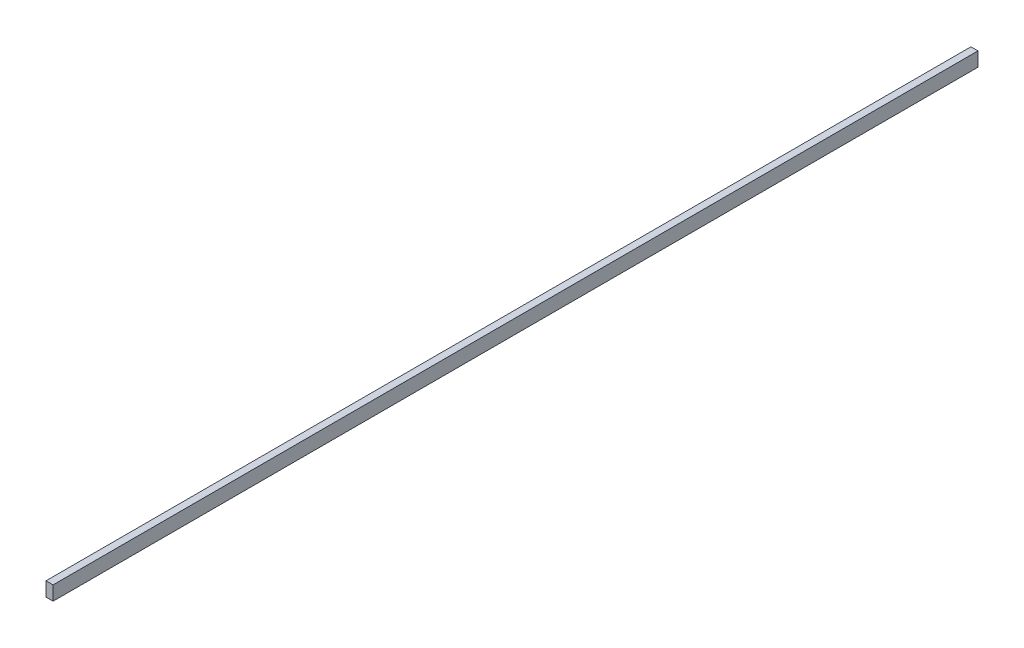
ISO-10303-21;
HEADER;
FILE_DESCRIPTION(('STEP AP214'),'2;1');
FILE_NAME('part.step','',(''),(''),'','','');
FILE_SCHEMA(('AUTOMOTIVE_DESIGN { 1 0 10303 214 1 1 1 1 }'));
ENDSEC;
DATA;
#1=APPLICATION_CONTEXT('core data for automotive mechanical design processes');
#2=APPLICATION_PROTOCOL_DEFINITION('international standard','automotive_design',2000,#1);
#3=PRODUCT_CONTEXT('',#1,'mechanical');
#4=PRODUCT('Part','Part','',(#3));
#5=PRODUCT_RELATED_PRODUCT_CATEGORY('part','',(#4));
#6=PRODUCT_DEFINITION_FORMATION('','',#4);
#7=PRODUCT_DEFINITION_CONTEXT('part definition',#1,'design');
#8=PRODUCT_DEFINITION('design','',#6,#7);
#9=PRODUCT_DEFINITION_SHAPE('','',#8);
#10=(LENGTH_UNIT() NAMED_UNIT(*) SI_UNIT(.MILLI.,.METRE.));
#11=(NAMED_UNIT(*) PLANE_ANGLE_UNIT() SI_UNIT($,.RADIAN.));
#12=(NAMED_UNIT(*) SI_UNIT($,.STERADIAN.) SOLID_ANGLE_UNIT());
#13=UNCERTAINTY_MEASURE_WITH_UNIT(LENGTH_MEASURE(1.E-05),#10,'distance_accuracy_value','');
#14=(GEOMETRIC_REPRESENTATION_CONTEXT(3) GLOBAL_UNCERTAINTY_ASSIGNED_CONTEXT((#13)) GLOBAL_UNIT_ASSIGNED_CONTEXT((#10,
#11,#12)) REPRESENTATION_CONTEXT('',''));
#15=CARTESIAN_POINT('',(0.,0.,0.));
#16=DIRECTION('',(0.,0.,1.));
#17=DIRECTION('',(1.,0.,0.));
#18=AXIS2_PLACEMENT_3D('',#15,#16,#17);
#19=CARTESIAN_POINT('',(0.,0.,415.));
#20=DIRECTION('',(1.,0.,0.));
#21=DIRECTION('',(0.,0.,-1.));
#22=AXIS2_PLACEMENT_3D('',#19,#20,#21);
#23=PLANE('',#22);
#24=DIRECTION('',(0.,-1.,0.));
#25=VECTOR('',#24,1.);
#26=CARTESIAN_POINT('',(0.,0.,0.));
#27=LINE('',#26,#25);
#28=CARTESIAN_POINT('',(0.,6.35,0.));
#29=VERTEX_POINT('',#28);
#30=CARTESIAN_POINT('',(0.,0.,0.));
#31=VERTEX_POINT('',#30);
#32=EDGE_CURVE('E107',#29,#31,#27,.T.);
#33=ORIENTED_EDGE('',*,*,#32,.T.);
#34=DIRECTION('',(0.,0.,-1.));
#35=VECTOR('',#34,1.);
#36=CARTESIAN_POINT('',(0.,0.,415.));
#37=LINE('',#36,#35);
#38=CARTESIAN_POINT('',(0.,0.,415.));
#39=VERTEX_POINT('',#38);
#40=EDGE_CURVE('E11',#39,#31,#37,.T.);
#41=ORIENTED_EDGE('',*,*,#40,.F.);
#42=DIRECTION('',(0.,-1.,0.));
#43=VECTOR('',#42,1.);
#44=CARTESIAN_POINT('',(0.,0.,415.));
#45=LINE('',#44,#43);
#46=CARTESIAN_POINT('',(0.,6.35,415.));
#47=VERTEX_POINT('',#46);
#48=EDGE_CURVE('E91',#47,#39,#45,.T.);
#49=ORIENTED_EDGE('',*,*,#48,.F.);
#50=DIRECTION('',(0.,0.,-1.));
#51=VECTOR('',#50,1.);
#52=CARTESIAN_POINT('',(0.,6.35,415.));
#53=LINE('',#52,#51);
#54=EDGE_CURVE('E103',#47,#29,#53,.T.);
#55=ORIENTED_EDGE('',*,*,#54,.T.);
#56=EDGE_LOOP('',(#33,#41,#49,#55));
#57=FACE_BOUND('',#56,.T.);
#58=ADVANCED_FACE('F39',(#57),#23,.F.);
#59=CARTESIAN_POINT('',(0.,0.,415.));
#60=DIRECTION('',(0.,1.,0.));
#61=DIRECTION('',(0.,0.,1.));
#62=AXIS2_PLACEMENT_3D('',#59,#60,#61);
#63=PLANE('',#62);
#64=DIRECTION('',(1.,0.,0.));
#65=VECTOR('',#64,1.);
#66=CARTESIAN_POINT('',(0.,0.,0.));
#67=LINE('',#66,#65);
#68=CARTESIAN_POINT('',(3.175,0.,0.));
#69=VERTEX_POINT('',#68);
#70=EDGE_CURVE('E96',#31,#69,#67,.T.);
#71=ORIENTED_EDGE('',*,*,#70,.T.);
#72=DIRECTION('',(0.,0.,-1.));
#73=VECTOR('',#72,1.);
#74=CARTESIAN_POINT('',(3.175,0.,415.));
#75=LINE('',#74,#73);
#76=CARTESIAN_POINT('',(3.175,0.,415.));
#77=VERTEX_POINT('',#76);
#78=EDGE_CURVE('E48',#77,#69,#75,.T.);
#79=ORIENTED_EDGE('',*,*,#78,.F.);
#80=DIRECTION('',(1.,0.,0.));
#81=VECTOR('',#80,1.);
#82=CARTESIAN_POINT('',(0.,0.,415.));
#83=LINE('',#82,#81);
#84=EDGE_CURVE('E86',#39,#77,#83,.T.);
#85=ORIENTED_EDGE('',*,*,#84,.F.);
#86=ORIENTED_EDGE('',*,*,#40,.T.);
#87=EDGE_LOOP('',(#71,#79,#85,#86));
#88=FACE_BOUND('',#87,.T.);
#89=ADVANCED_FACE('F95',(#88),#63,.F.);
#90=CARTESIAN_POINT('',(3.175,0.,415.));
#91=DIRECTION('',(-1.,0.,0.));
#92=DIRECTION('',(0.,0.,1.));
#93=AXIS2_PLACEMENT_3D('',#90,#91,#92);
#94=PLANE('',#93);
#95=DIRECTION('',(0.,1.,0.));
#96=VECTOR('',#95,1.);
#97=CARTESIAN_POINT('',(3.175,0.,0.));
#98=LINE('',#97,#96);
#99=CARTESIAN_POINT('',(3.175,6.35,0.));
#100=VERTEX_POINT('',#99);
#101=EDGE_CURVE('E73',#69,#100,#98,.T.);
#102=ORIENTED_EDGE('',*,*,#101,.T.);
#103=DIRECTION('',(0.,0.,-1.));
#104=VECTOR('',#103,1.);
#105=CARTESIAN_POINT('',(3.175,6.35,415.));
#106=LINE('',#105,#104);
#107=CARTESIAN_POINT('',(3.175,6.35,415.));
#108=VERTEX_POINT('',#107);
#109=EDGE_CURVE('E98',#108,#100,#106,.T.);
#110=ORIENTED_EDGE('',*,*,#109,.F.);
#111=DIRECTION('',(0.,1.,0.));
#112=VECTOR('',#111,1.);
#113=CARTESIAN_POINT('',(3.175,0.,415.));
#114=LINE('',#113,#112);
#115=EDGE_CURVE('E89',#77,#108,#114,.T.);
#116=ORIENTED_EDGE('',*,*,#115,.F.);
#117=ORIENTED_EDGE('',*,*,#78,.T.);
#118=EDGE_LOOP('',(#102,#110,#116,#117));
#119=FACE_BOUND('',#118,.T.);
#120=ADVANCED_FACE('F99',(#119),#94,.F.);
#121=CARTESIAN_POINT('',(0.,6.35,415.));
#122=DIRECTION('',(0.,-1.,0.));
#123=DIRECTION('',(0.,0.,-1.));
#124=AXIS2_PLACEMENT_3D('',#121,#122,#123);
#125=PLANE('',#124);
#126=DIRECTION('',(-1.,0.,0.));
#127=VECTOR('',#126,1.);
#128=CARTESIAN_POINT('',(0.,6.35,0.));
#129=LINE('',#128,#127);
#130=EDGE_CURVE('E79',#100,#29,#129,.T.);
#131=ORIENTED_EDGE('',*,*,#130,.T.);
#132=ORIENTED_EDGE('',*,*,#54,.F.);
#133=DIRECTION('',(-1.,0.,0.));
#134=VECTOR('',#133,1.);
#135=CARTESIAN_POINT('',(0.,6.35,415.));
#136=LINE('',#135,#134);
#137=EDGE_CURVE('E56',#108,#47,#136,.T.);
#138=ORIENTED_EDGE('',*,*,#137,.F.);
#139=ORIENTED_EDGE('',*,*,#109,.T.);
#140=EDGE_LOOP('',(#131,#132,#138,#139));
#141=FACE_BOUND('',#140,.T.);
#142=ADVANCED_FACE('F120',(#141),#125,.F.);
#143=CARTESIAN_POINT('',(0.,0.,415.));
#144=DIRECTION('',(0.,0.,-1.));
#145=DIRECTION('',(-1.,0.,0.));
#146=AXIS2_PLACEMENT_3D('',#143,#144,#145);
#147=PLANE('',#146);
#148=ORIENTED_EDGE('',*,*,#48,.T.);
#149=ORIENTED_EDGE('',*,*,#84,.T.);
#150=ORIENTED_EDGE('',*,*,#115,.T.);
#151=ORIENTED_EDGE('',*,*,#137,.T.);
#152=EDGE_LOOP('',(#148,#149,#150,#151));
#153=FACE_BOUND('',#152,.T.);
#154=ADVANCED_FACE('F87',(#153),#147,.F.);
#155=CARTESIAN_POINT('',(0.,0.,0.));
#156=DIRECTION('',(0.,0.,-1.));
#157=DIRECTION('',(-1.,0.,0.));
#158=AXIS2_PLACEMENT_3D('',#155,#156,#157);
#159=PLANE('',#158);
#160=ORIENTED_EDGE('',*,*,#32,.F.);
#161=ORIENTED_EDGE('',*,*,#130,.F.);
#162=ORIENTED_EDGE('',*,*,#101,.F.);
#163=ORIENTED_EDGE('',*,*,#70,.F.);
#164=EDGE_LOOP('',(#160,#161,#162,#163));
#165=FACE_BOUND('',#164,.T.);
#166=ADVANCED_FACE('F123',(#165),#159,.T.);
#167=CLOSED_SHELL('',(#58,#89,#120,#142,#154,#166));
#168=MANIFOLD_SOLID_BREP('B2',#167);
#169=ADVANCED_BREP_SHAPE_REPRESENTATION('',(#18,#168),#14);
#170=SHAPE_DEFINITION_REPRESENTATION(#9,#169);
ENDSEC;
END-ISO-10303-21;
